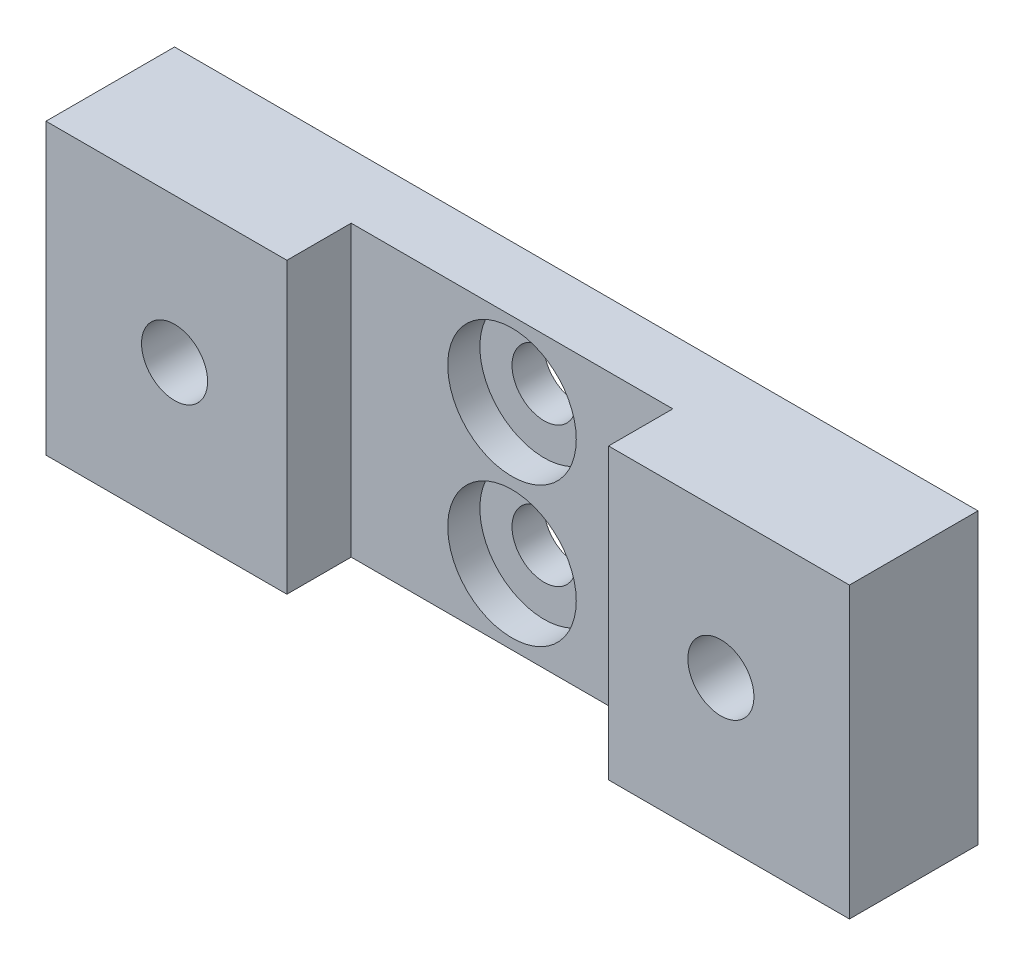
ISO-10303-21;
HEADER;
FILE_DESCRIPTION(('STEP AP214'),'2;1');
FILE_NAME('part.step','',(''),(''),'','','');
FILE_SCHEMA(('AUTOMOTIVE_DESIGN { 1 0 10303 214 1 1 1 1 }'));
ENDSEC;
DATA;
#1=APPLICATION_CONTEXT('core data for automotive mechanical design processes');
#2=APPLICATION_PROTOCOL_DEFINITION('international standard','automotive_design',2000,#1);
#3=PRODUCT_CONTEXT('',#1,'mechanical');
#4=PRODUCT('Part','Part','',(#3));
#5=PRODUCT_RELATED_PRODUCT_CATEGORY('part','',(#4));
#6=PRODUCT_DEFINITION_FORMATION('','',#4);
#7=PRODUCT_DEFINITION_CONTEXT('part definition',#1,'design');
#8=PRODUCT_DEFINITION('design','',#6,#7);
#9=PRODUCT_DEFINITION_SHAPE('','',#8);
#10=(LENGTH_UNIT() NAMED_UNIT(*) SI_UNIT(.MILLI.,.METRE.));
#11=(NAMED_UNIT(*) PLANE_ANGLE_UNIT() SI_UNIT($,.RADIAN.));
#12=(NAMED_UNIT(*) SI_UNIT($,.STERADIAN.) SOLID_ANGLE_UNIT());
#13=UNCERTAINTY_MEASURE_WITH_UNIT(LENGTH_MEASURE(1.E-05),#10,'distance_accuracy_value','');
#14=(GEOMETRIC_REPRESENTATION_CONTEXT(3) GLOBAL_UNCERTAINTY_ASSIGNED_CONTEXT((#13)) GLOBAL_UNIT_ASSIGNED_CONTEXT((#10,
#11,#12)) REPRESENTATION_CONTEXT('',''));
#15=CARTESIAN_POINT('',(0.,0.,0.));
#16=DIRECTION('',(0.,0.,1.));
#17=DIRECTION('',(1.,0.,0.));
#18=AXIS2_PLACEMENT_3D('',#15,#16,#17);
#19=CARTESIAN_POINT('',(-39.6875,28.575,12.7));
#20=DIRECTION('',(1.,0.,0.));
#21=DIRECTION('',(0.,0.,-1.));
#22=AXIS2_PLACEMENT_3D('',#19,#20,#21);
#23=PLANE('',#22);
#24=DIRECTION('',(0.,0.,1.));
#25=VECTOR('',#24,1.);
#26=CARTESIAN_POINT('',(-39.6875,0.,12.7));
#27=LINE('',#26,#25);
#28=CARTESIAN_POINT('',(-39.6875,0.,0.));
#29=VERTEX_POINT('',#28);
#30=CARTESIAN_POINT('',(-39.6875,0.,12.7));
#31=VERTEX_POINT('',#30);
#32=EDGE_CURVE('E131',#29,#31,#27,.T.);
#33=ORIENTED_EDGE('',*,*,#32,.T.);
#34=DIRECTION('',(0.,-1.,0.));
#35=VECTOR('',#34,1.);
#36=CARTESIAN_POINT('',(-39.6875,28.575,12.7));
#37=LINE('',#36,#35);
#38=CARTESIAN_POINT('',(-39.6875,28.575,12.7));
#39=VERTEX_POINT('',#38);
#40=EDGE_CURVE('E11',#39,#31,#37,.T.);
#41=ORIENTED_EDGE('',*,*,#40,.F.);
#42=DIRECTION('',(0.,0.,1.));
#43=VECTOR('',#42,1.);
#44=CARTESIAN_POINT('',(-39.6875,28.575,12.7));
#45=LINE('',#44,#43);
#46=CARTESIAN_POINT('',(-39.6875,28.575,0.));
#47=VERTEX_POINT('',#46);
#48=EDGE_CURVE('E146',#47,#39,#45,.T.);
#49=ORIENTED_EDGE('',*,*,#48,.F.);
#50=DIRECTION('',(0.,-1.,0.));
#51=VECTOR('',#50,1.);
#52=CARTESIAN_POINT('',(-39.6875,28.575,0.));
#53=LINE('',#52,#51);
#54=EDGE_CURVE('E127',#47,#29,#53,.T.);
#55=ORIENTED_EDGE('',*,*,#54,.T.);
#56=EDGE_LOOP('',(#33,#41,#49,#55));
#57=FACE_BOUND('',#56,.T.);
#58=ADVANCED_FACE('F35',(#57),#23,.F.);
#59=CARTESIAN_POINT('',(-15.8877,28.575,12.7));
#60=DIRECTION('',(0.,0.,-1.));
#61=DIRECTION('',(-1.,0.,0.));
#62=AXIS2_PLACEMENT_3D('',#59,#60,#61);
#63=PLANE('',#62);
#64=CARTESIAN_POINT('',(-26.9875,14.2875,12.7));
#65=DIRECTION('',(0.,0.,1.));
#66=DIRECTION('',(1.,0.,0.));
#67=AXIS2_PLACEMENT_3D('',#64,#65,#66);
#68=CIRCLE('',#67,3.2639);
#69=CARTESIAN_POINT('',(-23.7236,14.2875,12.7));
#70=VERTEX_POINT('',#69);
#71=EDGE_CURVE('E211',#70,#70,#68,.T.);
#72=ORIENTED_EDGE('',*,*,#71,.F.);
#73=EDGE_LOOP('',(#72));
#74=FACE_BOUND('',#73,.T.);
#75=DIRECTION('',(1.,0.,0.));
#76=VECTOR('',#75,1.);
#77=CARTESIAN_POINT('',(-15.8877,0.,12.7));
#78=LINE('',#77,#76);
#79=CARTESIAN_POINT('',(-15.8877,0.,12.7));
#80=VERTEX_POINT('',#79);
#81=EDGE_CURVE('E134',#31,#80,#78,.T.);
#82=ORIENTED_EDGE('',*,*,#81,.T.);
#83=DIRECTION('',(0.,-1.,0.));
#84=VECTOR('',#83,1.);
#85=CARTESIAN_POINT('',(-15.8877,28.575,12.7));
#86=LINE('',#85,#84);
#87=CARTESIAN_POINT('',(-15.8877,28.575,12.7));
#88=VERTEX_POINT('',#87);
#89=EDGE_CURVE('E43',#88,#80,#86,.T.);
#90=ORIENTED_EDGE('',*,*,#89,.F.);
#91=DIRECTION('',(1.,0.,0.));
#92=VECTOR('',#91,1.);
#93=CARTESIAN_POINT('',(-15.8877,28.575,12.7));
#94=LINE('',#93,#92);
#95=EDGE_CURVE('E94',#39,#88,#94,.T.);
#96=ORIENTED_EDGE('',*,*,#95,.F.);
#97=ORIENTED_EDGE('',*,*,#40,.T.);
#98=EDGE_LOOP('',(#82,#90,#96,#97));
#99=FACE_BOUND('',#98,.T.);
#100=ADVANCED_FACE('F217',(#74,#99),#63,.F.);
#101=CARTESIAN_POINT('',(-15.8877,28.575,6.35));
#102=DIRECTION('',(-1.,0.,0.));
#103=DIRECTION('',(0.,0.,1.));
#104=AXIS2_PLACEMENT_3D('',#101,#102,#103);
#105=PLANE('',#104);
#106=DIRECTION('',(0.,0.,-1.));
#107=VECTOR('',#106,1.);
#108=CARTESIAN_POINT('',(-15.8877,0.,6.35));
#109=LINE('',#108,#107);
#110=CARTESIAN_POINT('',(-15.8877,0.,6.35));
#111=VERTEX_POINT('',#110);
#112=EDGE_CURVE('E137',#80,#111,#109,.T.);
#113=ORIENTED_EDGE('',*,*,#112,.T.);
#114=DIRECTION('',(0.,-1.,0.));
#115=VECTOR('',#114,1.);
#116=CARTESIAN_POINT('',(-15.8877,28.575,6.35));
#117=LINE('',#116,#115);
#118=CARTESIAN_POINT('',(-15.8877,28.575,6.35));
#119=VERTEX_POINT('',#118);
#120=EDGE_CURVE('E153',#119,#111,#117,.T.);
#121=ORIENTED_EDGE('',*,*,#120,.F.);
#122=DIRECTION('',(0.,0.,-1.));
#123=VECTOR('',#122,1.);
#124=CARTESIAN_POINT('',(-15.8877,28.575,6.35));
#125=LINE('',#124,#123);
#126=EDGE_CURVE('E161',#88,#119,#125,.T.);
#127=ORIENTED_EDGE('',*,*,#126,.F.);
#128=ORIENTED_EDGE('',*,*,#89,.T.);
#129=EDGE_LOOP('',(#113,#121,#127,#128));
#130=FACE_BOUND('',#129,.T.);
#131=ADVANCED_FACE('F159',(#130),#105,.F.);
#132=CARTESIAN_POINT('',(15.8877,28.575,6.35));
#133=DIRECTION('',(0.,0.,-1.));
#134=DIRECTION('',(-1.,0.,0.));
#135=AXIS2_PLACEMENT_3D('',#132,#133,#134);
#136=PLANE('',#135);
#137=CARTESIAN_POINT('',(0.,7.3787,6.35));
#138=DIRECTION('',(0.,0.,1.));
#139=DIRECTION('',(1.,0.,0.));
#140=AXIS2_PLACEMENT_3D('',#137,#138,#139);
#141=CIRCLE('',#140,6.35);
#142=CARTESIAN_POINT('',(6.35,7.3787,6.35));
#143=VERTEX_POINT('',#142);
#144=EDGE_CURVE('E199',#143,#143,#141,.T.);
#145=ORIENTED_EDGE('',*,*,#144,.F.);
#146=EDGE_LOOP('',(#145));
#147=FACE_BOUND('',#146,.T.);
#148=CARTESIAN_POINT('',(0.,21.1963,6.35));
#149=DIRECTION('',(0.,0.,1.));
#150=DIRECTION('',(1.,0.,0.));
#151=AXIS2_PLACEMENT_3D('',#148,#149,#150);
#152=CIRCLE('',#151,6.35);
#153=CARTESIAN_POINT('',(6.35,21.1963,6.35));
#154=VERTEX_POINT('',#153);
#155=EDGE_CURVE('E187',#154,#154,#152,.T.);
#156=ORIENTED_EDGE('',*,*,#155,.F.);
#157=EDGE_LOOP('',(#156));
#158=FACE_BOUND('',#157,.T.);
#159=DIRECTION('',(1.,0.,0.));
#160=VECTOR('',#159,1.);
#161=CARTESIAN_POINT('',(15.8877,0.,6.35));
#162=LINE('',#161,#160);
#163=CARTESIAN_POINT('',(15.8877,0.,6.35));
#164=VERTEX_POINT('',#163);
#165=EDGE_CURVE('E139',#111,#164,#162,.T.);
#166=ORIENTED_EDGE('',*,*,#165,.T.);
#167=DIRECTION('',(0.,-1.,0.));
#168=VECTOR('',#167,1.);
#169=CARTESIAN_POINT('',(15.8877,28.575,6.35));
#170=LINE('',#169,#168);
#171=CARTESIAN_POINT('',(15.8877,28.575,6.35));
#172=VERTEX_POINT('',#171);
#173=EDGE_CURVE('E150',#172,#164,#170,.T.);
#174=ORIENTED_EDGE('',*,*,#173,.F.);
#175=DIRECTION('',(1.,0.,0.));
#176=VECTOR('',#175,1.);
#177=CARTESIAN_POINT('',(15.8877,28.575,6.35));
#178=LINE('',#177,#176);
#179=EDGE_CURVE('E173',#119,#172,#178,.T.);
#180=ORIENTED_EDGE('',*,*,#179,.F.);
#181=ORIENTED_EDGE('',*,*,#120,.T.);
#182=EDGE_LOOP('',(#166,#174,#180,#181));
#183=FACE_BOUND('',#182,.T.);
#184=ADVANCED_FACE('F169',(#147,#158,#183),#136,.F.);
#185=CARTESIAN_POINT('',(15.8877,28.575,12.7));
#186=DIRECTION('',(1.,0.,0.));
#187=DIRECTION('',(0.,0.,-1.));
#188=AXIS2_PLACEMENT_3D('',#185,#186,#187);
#189=PLANE('',#188);
#190=DIRECTION('',(0.,0.,1.));
#191=VECTOR('',#190,1.);
#192=CARTESIAN_POINT('',(15.8877,0.,12.7));
#193=LINE('',#192,#191);
#194=CARTESIAN_POINT('',(15.8877,0.,12.7));
#195=VERTEX_POINT('',#194);
#196=EDGE_CURVE('E141',#164,#195,#193,.T.);
#197=ORIENTED_EDGE('',*,*,#196,.T.);
#198=DIRECTION('',(0.,-1.,0.));
#199=VECTOR('',#198,1.);
#200=CARTESIAN_POINT('',(15.8877,28.575,12.7));
#201=LINE('',#200,#199);
#202=CARTESIAN_POINT('',(15.8877,28.575,12.7));
#203=VERTEX_POINT('',#202);
#204=EDGE_CURVE('E122',#203,#195,#201,.T.);
#205=ORIENTED_EDGE('',*,*,#204,.F.);
#206=DIRECTION('',(0.,0.,1.));
#207=VECTOR('',#206,1.);
#208=CARTESIAN_POINT('',(15.8877,28.575,12.7));
#209=LINE('',#208,#207);
#210=EDGE_CURVE('E113',#172,#203,#209,.T.);
#211=ORIENTED_EDGE('',*,*,#210,.F.);
#212=ORIENTED_EDGE('',*,*,#173,.T.);
#213=EDGE_LOOP('',(#197,#205,#211,#212));
#214=FACE_BOUND('',#213,.T.);
#215=ADVANCED_FACE('F172',(#214),#189,.F.);
#216=CARTESIAN_POINT('',(39.6875,28.575,12.7));
#217=DIRECTION('',(0.,0.,-1.));
#218=DIRECTION('',(-1.,0.,0.));
#219=AXIS2_PLACEMENT_3D('',#216,#217,#218);
#220=PLANE('',#219);
#221=CARTESIAN_POINT('',(26.9875,14.2875,12.7));
#222=DIRECTION('',(0.,0.,1.));
#223=DIRECTION('',(1.,0.,0.));
#224=AXIS2_PLACEMENT_3D('',#221,#222,#223);
#225=CIRCLE('',#224,3.2639);
#226=CARTESIAN_POINT('',(30.2514,14.2875,12.7));
#227=VERTEX_POINT('',#226);
#228=EDGE_CURVE('E205',#227,#227,#225,.T.);
#229=ORIENTED_EDGE('',*,*,#228,.F.);
#230=EDGE_LOOP('',(#229));
#231=FACE_BOUND('',#230,.T.);
#232=DIRECTION('',(1.,0.,0.));
#233=VECTOR('',#232,1.);
#234=CARTESIAN_POINT('',(39.6875,0.,12.7));
#235=LINE('',#234,#233);
#236=CARTESIAN_POINT('',(39.6875,0.,12.7));
#237=VERTEX_POINT('',#236);
#238=EDGE_CURVE('E121',#195,#237,#235,.T.);
#239=ORIENTED_EDGE('',*,*,#238,.T.);
#240=DIRECTION('',(0.,-1.,0.));
#241=VECTOR('',#240,1.);
#242=CARTESIAN_POINT('',(39.6875,28.575,12.7));
#243=LINE('',#242,#241);
#244=CARTESIAN_POINT('',(39.6875,28.575,12.7));
#245=VERTEX_POINT('',#244);
#246=EDGE_CURVE('E118',#245,#237,#243,.T.);
#247=ORIENTED_EDGE('',*,*,#246,.F.);
#248=DIRECTION('',(1.,0.,0.));
#249=VECTOR('',#248,1.);
#250=CARTESIAN_POINT('',(39.6875,28.575,12.7));
#251=LINE('',#250,#249);
#252=EDGE_CURVE('E107',#203,#245,#251,.T.);
#253=ORIENTED_EDGE('',*,*,#252,.F.);
#254=ORIENTED_EDGE('',*,*,#204,.T.);
#255=EDGE_LOOP('',(#239,#247,#253,#254));
#256=FACE_BOUND('',#255,.T.);
#257=ADVANCED_FACE('F119',(#231,#256),#220,.F.);
#258=CARTESIAN_POINT('',(39.6875,28.575,0.));
#259=DIRECTION('',(-1.,0.,0.));
#260=DIRECTION('',(0.,0.,1.));
#261=AXIS2_PLACEMENT_3D('',#258,#259,#260);
#262=PLANE('',#261);
#263=DIRECTION('',(0.,0.,-1.));
#264=VECTOR('',#263,1.);
#265=CARTESIAN_POINT('',(39.6875,0.,0.));
#266=LINE('',#265,#264);
#267=CARTESIAN_POINT('',(39.6875,0.,0.));
#268=VERTEX_POINT('',#267);
#269=EDGE_CURVE('E80',#237,#268,#266,.T.);
#270=ORIENTED_EDGE('',*,*,#269,.T.);
#271=DIRECTION('',(0.,-1.,0.));
#272=VECTOR('',#271,1.);
#273=CARTESIAN_POINT('',(39.6875,28.575,0.));
#274=LINE('',#273,#272);
#275=CARTESIAN_POINT('',(39.6875,28.575,0.));
#276=VERTEX_POINT('',#275);
#277=EDGE_CURVE('E123',#276,#268,#274,.T.);
#278=ORIENTED_EDGE('',*,*,#277,.F.);
#279=DIRECTION('',(0.,0.,-1.));
#280=VECTOR('',#279,1.);
#281=CARTESIAN_POINT('',(39.6875,28.575,0.));
#282=LINE('',#281,#280);
#283=EDGE_CURVE('E111',#245,#276,#282,.T.);
#284=ORIENTED_EDGE('',*,*,#283,.F.);
#285=ORIENTED_EDGE('',*,*,#246,.T.);
#286=EDGE_LOOP('',(#270,#278,#284,#285));
#287=FACE_BOUND('',#286,.T.);
#288=ADVANCED_FACE('F125',(#287),#262,.F.);
#289=CARTESIAN_POINT('',(-39.6875,28.575,0.));
#290=DIRECTION('',(0.,0.,1.));
#291=DIRECTION('',(1.,0.,0.));
#292=AXIS2_PLACEMENT_3D('',#289,#290,#291);
#293=PLANE('',#292);
#294=CARTESIAN_POINT('',(-26.9875,14.2875,0.));
#295=DIRECTION('',(0.,0.,1.));
#296=DIRECTION('',(1.,0.,0.));
#297=AXIS2_PLACEMENT_3D('',#294,#295,#296);
#298=CIRCLE('',#297,3.2639);
#299=CARTESIAN_POINT('',(-23.7236,14.2875,0.));
#300=VERTEX_POINT('',#299);
#301=EDGE_CURVE('E208',#300,#300,#298,.T.);
#302=ORIENTED_EDGE('',*,*,#301,.T.);
#303=EDGE_LOOP('',(#302));
#304=FACE_BOUND('',#303,.T.);
#305=CARTESIAN_POINT('',(26.9875,14.2875,0.));
#306=DIRECTION('',(0.,0.,1.));
#307=DIRECTION('',(1.,0.,0.));
#308=AXIS2_PLACEMENT_3D('',#305,#306,#307);
#309=CIRCLE('',#308,3.2639);
#310=CARTESIAN_POINT('',(30.2514,14.2875,0.));
#311=VERTEX_POINT('',#310);
#312=EDGE_CURVE('E202',#311,#311,#309,.T.);
#313=ORIENTED_EDGE('',*,*,#312,.T.);
#314=EDGE_LOOP('',(#313));
#315=FACE_BOUND('',#314,.T.);
#316=CARTESIAN_POINT('',(0.,7.3787,0.));
#317=DIRECTION('',(0.,0.,1.));
#318=DIRECTION('',(1.,0.,0.));
#319=AXIS2_PLACEMENT_3D('',#316,#317,#318);
#320=CIRCLE('',#319,3.175);
#321=CARTESIAN_POINT('',(3.175,7.3787,0.));
#322=VERTEX_POINT('',#321);
#323=EDGE_CURVE('E190',#322,#322,#320,.T.);
#324=ORIENTED_EDGE('',*,*,#323,.T.);
#325=EDGE_LOOP('',(#324));
#326=FACE_BOUND('',#325,.T.);
#327=CARTESIAN_POINT('',(0.,21.1963,0.));
#328=DIRECTION('',(0.,0.,1.));
#329=DIRECTION('',(1.,0.,0.));
#330=AXIS2_PLACEMENT_3D('',#327,#328,#329);
#331=CIRCLE('',#330,3.175);
#332=CARTESIAN_POINT('',(3.175,21.1963,0.));
#333=VERTEX_POINT('',#332);
#334=EDGE_CURVE('E135',#333,#333,#331,.T.);
#335=ORIENTED_EDGE('',*,*,#334,.T.);
#336=EDGE_LOOP('',(#335));
#337=FACE_BOUND('',#336,.T.);
#338=DIRECTION('',(-1.,0.,0.));
#339=VECTOR('',#338,1.);
#340=CARTESIAN_POINT('',(-39.6875,0.,0.));
#341=LINE('',#340,#339);
#342=EDGE_CURVE('E86',#268,#29,#341,.T.);
#343=ORIENTED_EDGE('',*,*,#342,.T.);
#344=ORIENTED_EDGE('',*,*,#54,.F.);
#345=DIRECTION('',(-1.,0.,0.));
#346=VECTOR('',#345,1.);
#347=CARTESIAN_POINT('',(-39.6875,28.575,0.));
#348=LINE('',#347,#346);
#349=EDGE_CURVE('E51',#276,#47,#348,.T.);
#350=ORIENTED_EDGE('',*,*,#349,.F.);
#351=ORIENTED_EDGE('',*,*,#277,.T.);
#352=EDGE_LOOP('',(#343,#344,#350,#351));
#353=FACE_BOUND('',#352,.T.);
#354=ADVANCED_FACE('F222',(#304,#315,#326,#337,#353),#293,.F.);
#355=CARTESIAN_POINT('',(0.,28.575,0.));
#356=DIRECTION('',(0.,-1.,0.));
#357=DIRECTION('',(0.,0.,-1.));
#358=AXIS2_PLACEMENT_3D('',#355,#356,#357);
#359=PLANE('',#358);
#360=ORIENTED_EDGE('',*,*,#48,.T.);
#361=ORIENTED_EDGE('',*,*,#95,.T.);
#362=ORIENTED_EDGE('',*,*,#126,.T.);
#363=ORIENTED_EDGE('',*,*,#179,.T.);
#364=ORIENTED_EDGE('',*,*,#210,.T.);
#365=ORIENTED_EDGE('',*,*,#252,.T.);
#366=ORIENTED_EDGE('',*,*,#283,.T.);
#367=ORIENTED_EDGE('',*,*,#349,.T.);
#368=EDGE_LOOP('',(#360,#361,#362,#363,#364,#365,#366,#367));
#369=FACE_BOUND('',#368,.T.);
#370=ADVANCED_FACE('F109',(#369),#359,.F.);
#371=CARTESIAN_POINT('',(0.,0.,0.));
#372=DIRECTION('',(0.,-1.,0.));
#373=DIRECTION('',(0.,0.,-1.));
#374=AXIS2_PLACEMENT_3D('',#371,#372,#373);
#375=PLANE('',#374);
#376=ORIENTED_EDGE('',*,*,#32,.F.);
#377=ORIENTED_EDGE('',*,*,#342,.F.);
#378=ORIENTED_EDGE('',*,*,#269,.F.);
#379=ORIENTED_EDGE('',*,*,#238,.F.);
#380=ORIENTED_EDGE('',*,*,#196,.F.);
#381=ORIENTED_EDGE('',*,*,#165,.F.);
#382=ORIENTED_EDGE('',*,*,#112,.F.);
#383=ORIENTED_EDGE('',*,*,#81,.F.);
#384=EDGE_LOOP('',(#376,#377,#378,#379,#380,#381,#382,#383));
#385=FACE_BOUND('',#384,.T.);
#386=ADVANCED_FACE('F165',(#385),#375,.T.);
#387=CARTESIAN_POINT('',(0.,21.1963,6.35));
#388=DIRECTION('',(0.,0.,1.));
#389=DIRECTION('',(1.,0.,0.));
#390=AXIS2_PLACEMENT_3D('',#387,#388,#389);
#391=CYLINDRICAL_SURFACE('',#390,3.17500000000001);
#392=ORIENTED_EDGE('',*,*,#334,.F.);
#393=EDGE_LOOP('',(#392));
#394=FACE_BOUND('',#393,.T.);
#395=CARTESIAN_POINT('',(0.,21.1963,3.17500000000001));
#396=DIRECTION('',(0.,0.,1.));
#397=DIRECTION('',(1.,0.,0.));
#398=AXIS2_PLACEMENT_3D('',#395,#396,#397);
#399=CIRCLE('',#398,3.17500000000001);
#400=CARTESIAN_POINT('',(3.17500000000001,21.1963,3.17500000000001));
#401=VERTEX_POINT('',#400);
#402=EDGE_CURVE('E181',#401,#401,#399,.T.);
#403=ORIENTED_EDGE('',*,*,#402,.T.);
#404=EDGE_LOOP('',(#403));
#405=FACE_BOUND('',#404,.T.);
#406=ADVANCED_FACE('F288',(#394,#405),#391,.F.);
#407=CARTESIAN_POINT('',(3.17500000000001,21.1963,3.175));
#408=DIRECTION('',(0.,0.,-1.));
#409=DIRECTION('',(-1.,0.,0.));
#410=AXIS2_PLACEMENT_3D('',#407,#408,#409);
#411=PLANE('',#410);
#412=ORIENTED_EDGE('',*,*,#402,.F.);
#413=EDGE_LOOP('',(#412));
#414=FACE_BOUND('',#413,.T.);
#415=CARTESIAN_POINT('',(0.,21.1963,3.175));
#416=DIRECTION('',(0.,0.,1.));
#417=DIRECTION('',(1.,0.,0.));
#418=AXIS2_PLACEMENT_3D('',#415,#416,#417);
#419=CIRCLE('',#418,6.35);
#420=CARTESIAN_POINT('',(6.35,21.1963,3.175));
#421=VERTEX_POINT('',#420);
#422=EDGE_CURVE('E184',#421,#421,#419,.T.);
#423=ORIENTED_EDGE('',*,*,#422,.T.);
#424=EDGE_LOOP('',(#423));
#425=FACE_BOUND('',#424,.T.);
#426=ADVANCED_FACE('F296',(#414,#425),#411,.F.);
#427=CARTESIAN_POINT('',(0.,21.1963,6.35));
#428=DIRECTION('',(0.,0.,1.));
#429=DIRECTION('',(1.,0.,0.));
#430=AXIS2_PLACEMENT_3D('',#427,#428,#429);
#431=CYLINDRICAL_SURFACE('',#430,6.35);
#432=ORIENTED_EDGE('',*,*,#422,.F.);
#433=EDGE_LOOP('',(#432));
#434=FACE_BOUND('',#433,.T.);
#435=ORIENTED_EDGE('',*,*,#155,.T.);
#436=EDGE_LOOP('',(#435));
#437=FACE_BOUND('',#436,.T.);
#438=ADVANCED_FACE('F303',(#434,#437),#431,.F.);
#439=CARTESIAN_POINT('',(0.,7.3787,6.35));
#440=DIRECTION('',(0.,0.,1.));
#441=DIRECTION('',(1.,0.,0.));
#442=AXIS2_PLACEMENT_3D('',#439,#440,#441);
#443=CYLINDRICAL_SURFACE('',#442,3.17500000000001);
#444=ORIENTED_EDGE('',*,*,#323,.F.);
#445=EDGE_LOOP('',(#444));
#446=FACE_BOUND('',#445,.T.);
#447=CARTESIAN_POINT('',(0.,7.3787,3.17500000000001));
#448=DIRECTION('',(0.,0.,1.));
#449=DIRECTION('',(1.,0.,0.));
#450=AXIS2_PLACEMENT_3D('',#447,#448,#449);
#451=CIRCLE('',#450,3.17500000000001);
#452=CARTESIAN_POINT('',(3.17500000000001,7.3787,3.17500000000001));
#453=VERTEX_POINT('',#452);
#454=EDGE_CURVE('E193',#453,#453,#451,.T.);
#455=ORIENTED_EDGE('',*,*,#454,.T.);
#456=EDGE_LOOP('',(#455));
#457=FACE_BOUND('',#456,.T.);
#458=ADVANCED_FACE('F311',(#446,#457),#443,.F.);
#459=CARTESIAN_POINT('',(3.17500000000001,7.3787,3.175));
#460=DIRECTION('',(0.,0.,-1.));
#461=DIRECTION('',(-1.,0.,0.));
#462=AXIS2_PLACEMENT_3D('',#459,#460,#461);
#463=PLANE('',#462);
#464=ORIENTED_EDGE('',*,*,#454,.F.);
#465=EDGE_LOOP('',(#464));
#466=FACE_BOUND('',#465,.T.);
#467=CARTESIAN_POINT('',(0.,7.3787,3.175));
#468=DIRECTION('',(0.,0.,1.));
#469=DIRECTION('',(1.,0.,0.));
#470=AXIS2_PLACEMENT_3D('',#467,#468,#469);
#471=CIRCLE('',#470,6.35);
#472=CARTESIAN_POINT('',(6.35,7.3787,3.175));
#473=VERTEX_POINT('',#472);
#474=EDGE_CURVE('E196',#473,#473,#471,.T.);
#475=ORIENTED_EDGE('',*,*,#474,.T.);
#476=EDGE_LOOP('',(#475));
#477=FACE_BOUND('',#476,.T.);
#478=ADVANCED_FACE('F319',(#466,#477),#463,.F.);
#479=CARTESIAN_POINT('',(0.,7.3787,6.35));
#480=DIRECTION('',(0.,0.,1.));
#481=DIRECTION('',(1.,0.,0.));
#482=AXIS2_PLACEMENT_3D('',#479,#480,#481);
#483=CYLINDRICAL_SURFACE('',#482,6.35);
#484=ORIENTED_EDGE('',*,*,#474,.F.);
#485=EDGE_LOOP('',(#484));
#486=FACE_BOUND('',#485,.T.);
#487=ORIENTED_EDGE('',*,*,#144,.T.);
#488=EDGE_LOOP('',(#487));
#489=FACE_BOUND('',#488,.T.);
#490=ADVANCED_FACE('F327',(#486,#489),#483,.F.);
#491=CARTESIAN_POINT('',(26.9875,14.2875,12.7));
#492=DIRECTION('',(0.,0.,1.));
#493=DIRECTION('',(1.,0.,0.));
#494=AXIS2_PLACEMENT_3D('',#491,#492,#493);
#495=CYLINDRICAL_SURFACE('',#494,3.2639);
#496=ORIENTED_EDGE('',*,*,#312,.F.);
#497=EDGE_LOOP('',(#496));
#498=FACE_BOUND('',#497,.T.);
#499=ORIENTED_EDGE('',*,*,#228,.T.);
#500=EDGE_LOOP('',(#499));
#501=FACE_BOUND('',#500,.T.);
#502=ADVANCED_FACE('F334',(#498,#501),#495,.F.);
#503=CARTESIAN_POINT('',(-26.9875,14.2875,12.7));
#504=DIRECTION('',(0.,0.,1.));
#505=DIRECTION('',(1.,0.,0.));
#506=AXIS2_PLACEMENT_3D('',#503,#504,#505);
#507=CYLINDRICAL_SURFACE('',#506,3.2639);
#508=ORIENTED_EDGE('',*,*,#301,.F.);
#509=EDGE_LOOP('',(#508));
#510=FACE_BOUND('',#509,.T.);
#511=ORIENTED_EDGE('',*,*,#71,.T.);
#512=EDGE_LOOP('',(#511));
#513=FACE_BOUND('',#512,.T.);
#514=ADVANCED_FACE('F215',(#510,#513),#507,.F.);
#515=CLOSED_SHELL('',(#58,#100,#131,#184,#215,#257,#288,#354,#370,#386,#406,#426,#438,#458,#478,
#490,#502,#514));
#516=MANIFOLD_SOLID_BREP('B2',#515);
#517=ADVANCED_BREP_SHAPE_REPRESENTATION('',(#18,#516),#14);
#518=SHAPE_DEFINITION_REPRESENTATION(#9,#517);
ENDSEC;
END-ISO-10303-21;
